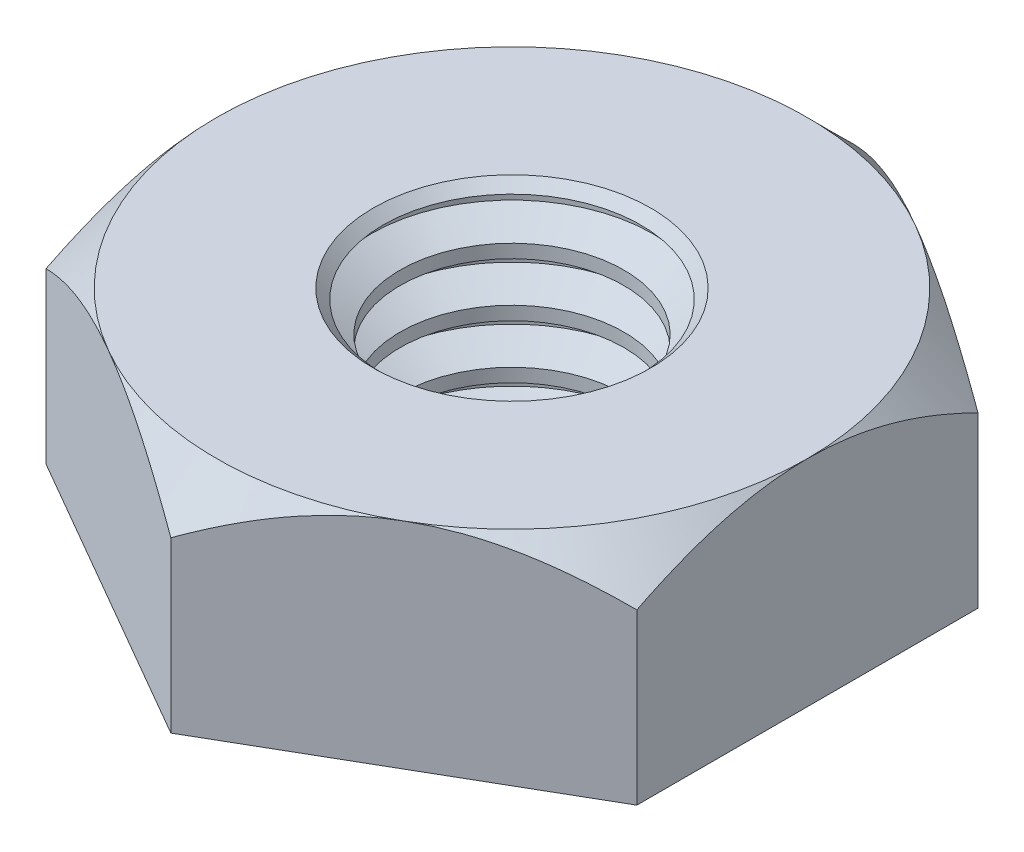
ISO-10303-21;
HEADER;
FILE_DESCRIPTION(('STEP AP214'),'2;1');
FILE_NAME('part.step','',(''),(''),'','','');
FILE_SCHEMA(('AUTOMOTIVE_DESIGN { 1 0 10303 214 1 1 1 1 }'));
ENDSEC;
DATA;
#1=APPLICATION_CONTEXT('core data for automotive mechanical design processes');
#2=APPLICATION_PROTOCOL_DEFINITION('international standard','automotive_design',2000,#1);
#3=PRODUCT_CONTEXT('',#1,'mechanical');
#4=PRODUCT('Part','Part','',(#3));
#5=PRODUCT_RELATED_PRODUCT_CATEGORY('part','',(#4));
#6=PRODUCT_DEFINITION_FORMATION('','',#4);
#7=PRODUCT_DEFINITION_CONTEXT('part definition',#1,'design');
#8=PRODUCT_DEFINITION('design','',#6,#7);
#9=PRODUCT_DEFINITION_SHAPE('','',#8);
#10=(LENGTH_UNIT() NAMED_UNIT(*) SI_UNIT(.MILLI.,.METRE.));
#11=(NAMED_UNIT(*) PLANE_ANGLE_UNIT() SI_UNIT($,.RADIAN.));
#12=(NAMED_UNIT(*) SI_UNIT($,.STERADIAN.) SOLID_ANGLE_UNIT());
#13=UNCERTAINTY_MEASURE_WITH_UNIT(LENGTH_MEASURE(1.E-05),#10,'distance_accuracy_value','');
#14=(GEOMETRIC_REPRESENTATION_CONTEXT(3) GLOBAL_UNCERTAINTY_ASSIGNED_CONTEXT((#13)) GLOBAL_UNIT_ASSIGNED_CONTEXT((#10,
#11,#12)) REPRESENTATION_CONTEXT('',''));
#15=CARTESIAN_POINT('',(0.,0.,0.));
#16=DIRECTION('',(0.,0.,1.));
#17=DIRECTION('',(1.,0.,0.));
#18=AXIS2_PLACEMENT_3D('',#15,#16,#17);
#19=CARTESIAN_POINT('',(0.,0.869828540984293,0.));
#20=DIRECTION('',(0.,1.,0.));
#21=DIRECTION('',(0.,0.,1.));
#22=AXIS2_PLACEMENT_3D('',#19,#20,#21);
#23=CYLINDRICAL_SURFACE('',#22,2.0828);
#24=CARTESIAN_POINT('',(0.,2.03398437497526,0.));
#25=DIRECTION('',(0.,1.,0.));
#26=DIRECTION('',(0.,0.,1.));
#27=AXIS2_PLACEMENT_3D('',#24,#25,#26);
#28=CIRCLE('',#27,2.0827999999824);
#29=CARTESIAN_POINT('',(0.,2.03398437497526,2.0827999999824));
#30=VERTEX_POINT('',#29);
#31=EDGE_CURVE('E346',#30,#30,#28,.F.);
#32=ORIENTED_EDGE('',*,*,#31,.T.);
#33=EDGE_LOOP('',(#32));
#34=FACE_BOUND('',#33,.T.);
#35=CARTESIAN_POINT('',(0.,2.13320312502674,0.));
#36=DIRECTION('',(0.,-1.,0.));
#37=DIRECTION('',(0.,0.,-1.));
#38=AXIS2_PLACEMENT_3D('',#35,#36,#37);
#39=CIRCLE('',#38,2.0827999999824);
#40=CARTESIAN_POINT('',(0.,2.13320312502674,-2.0827999999824));
#41=VERTEX_POINT('',#40);
#42=EDGE_CURVE('E342',#41,#41,#39,.F.);
#43=ORIENTED_EDGE('',*,*,#42,.T.);
#44=EDGE_LOOP('',(#43));
#45=FACE_BOUND('',#44,.T.);
#46=ADVANCED_FACE('F18',(#34,#45),#23,.F.);
#47=CARTESIAN_POINT('',(0.,2.03398437497526,0.));
#48=DIRECTION('',(0.,1.,0.));
#49=DIRECTION('',(0.,0.,1.));
#50=AXIS2_PLACEMENT_3D('',#47,#48,#49);
#51=CONICAL_SURFACE('',#50,2.0827999999824,1.04719755122981);
#52=CARTESIAN_POINT('',(0.,1.7859375,0.));
#53=DIRECTION('',(0.,1.,0.));
#54=DIRECTION('',(0.,0.,1.));
#55=AXIS2_PLACEMENT_3D('',#52,#53,#54);
#56=CIRCLE('',#55,1.65317020984131);
#57=CARTESIAN_POINT('',(0.,1.7859375,1.65317020984131));
#58=VERTEX_POINT('',#57);
#59=EDGE_CURVE('E338',#58,#58,#56,.F.);
#60=ORIENTED_EDGE('',*,*,#59,.T.);
#61=EDGE_LOOP('',(#60));
#62=FACE_BOUND('',#61,.T.);
#63=ORIENTED_EDGE('',*,*,#31,.F.);
#64=EDGE_LOOP('',(#63));
#65=FACE_BOUND('',#64,.T.);
#66=ADVANCED_FACE('F353',(#62,#65),#51,.F.);
#67=CARTESIAN_POINT('',(0.,2.13320312502674,0.));
#68=DIRECTION('',(0.,-1.,0.));
#69=DIRECTION('',(0.,0.,-1.));
#70=AXIS2_PLACEMENT_3D('',#67,#68,#69);
#71=CONICAL_SURFACE('',#70,2.0827999999824,1.04719755118787);
#72=CARTESIAN_POINT('',(0.,2.38125,0.));
#73=DIRECTION('',(0.,1.,0.));
#74=DIRECTION('',(0.,0.,1.));
#75=AXIS2_PLACEMENT_3D('',#72,#73,#74);
#76=CIRCLE('',#75,1.65317020984131);
#77=CARTESIAN_POINT('',(0.,2.38125,1.65317020984131));
#78=VERTEX_POINT('',#77);
#79=EDGE_CURVE('E334',#78,#78,#76,.T.);
#80=ORIENTED_EDGE('',*,*,#79,.T.);
#81=EDGE_LOOP('',(#80));
#82=FACE_BOUND('',#81,.T.);
#83=ORIENTED_EDGE('',*,*,#42,.F.);
#84=EDGE_LOOP('',(#83));
#85=FACE_BOUND('',#84,.T.);
#86=ADVANCED_FACE('F355',(#82,#85),#71,.F.);
#87=CARTESIAN_POINT('',(0.,0.869828540984293,0.));
#88=DIRECTION('',(0.,1.,0.));
#89=DIRECTION('',(0.,0.,1.));
#90=AXIS2_PLACEMENT_3D('',#87,#88,#89);
#91=CYLINDRICAL_SURFACE('',#90,1.65317020984131);
#92=CARTESIAN_POINT('',(0.,1.58750000002783,0.));
#93=DIRECTION('',(0.,-1.,0.));
#94=DIRECTION('',(0.,0.,-1.));
#95=AXIS2_PLACEMENT_3D('',#92,#93,#94);
#96=CIRCLE('',#95,1.65317020980638);
#97=CARTESIAN_POINT('',(0.,1.58750000002783,-1.65317020980638));
#98=VERTEX_POINT('',#97);
#99=EDGE_CURVE('E330',#98,#98,#96,.T.);
#100=ORIENTED_EDGE('',*,*,#99,.T.);
#101=EDGE_LOOP('',(#100));
#102=FACE_BOUND('',#101,.T.);
#103=ORIENTED_EDGE('',*,*,#59,.F.);
#104=EDGE_LOOP('',(#103));
#105=FACE_BOUND('',#104,.T.);
#106=ADVANCED_FACE('F361',(#102,#105),#91,.F.);
#107=CARTESIAN_POINT('',(0.,1.66357854098429,0.));
#108=DIRECTION('',(0.,1.,0.));
#109=DIRECTION('',(0.,0.,1.));
#110=AXIS2_PLACEMENT_3D('',#107,#108,#109);
#111=CYLINDRICAL_SURFACE('',#110,1.65317020984131);
#112=ORIENTED_EDGE('',*,*,#79,.F.);
#113=EDGE_LOOP('',(#112));
#114=FACE_BOUND('',#113,.T.);
#115=CARTESIAN_POINT('',(0.,2.57968749997417,0.));
#116=DIRECTION('',(0.,1.,0.));
#117=DIRECTION('',(0.,0.,1.));
#118=AXIS2_PLACEMENT_3D('',#115,#116,#117);
#119=CIRCLE('',#118,1.65317020986322);
#120=CARTESIAN_POINT('',(0.,2.57968749997417,1.65317020986322));
#121=VERTEX_POINT('',#120);
#122=EDGE_CURVE('E326',#121,#121,#119,.T.);
#123=ORIENTED_EDGE('',*,*,#122,.T.);
#124=EDGE_LOOP('',(#123));
#125=FACE_BOUND('',#124,.T.);
#126=ADVANCED_FACE('F367',(#114,#125),#111,.F.);
#127=CARTESIAN_POINT('',(0.,1.33945312501282,0.));
#128=DIRECTION('',(0.,-1.,0.));
#129=DIRECTION('',(0.,0.,-1.));
#130=AXIS2_PLACEMENT_3D('',#127,#128,#129);
#131=CONICAL_SURFACE('',#130,2.0827999999824,1.04719755118787);
#132=ORIENTED_EDGE('',*,*,#99,.F.);
#133=EDGE_LOOP('',(#132));
#134=FACE_BOUND('',#133,.T.);
#135=CARTESIAN_POINT('',(0.,1.339453125,0.));
#136=DIRECTION('',(0.,1.,0.));
#137=DIRECTION('',(0.,0.,1.));
#138=AXIS2_PLACEMENT_3D('',#135,#136,#137);
#139=CIRCLE('',#138,2.0828);
#140=CARTESIAN_POINT('',(0.,1.339453125,2.0828));
#141=VERTEX_POINT('',#140);
#142=EDGE_CURVE('E322',#141,#141,#139,.F.);
#143=ORIENTED_EDGE('',*,*,#142,.T.);
#144=EDGE_LOOP('',(#143));
#145=FACE_BOUND('',#144,.T.);
#146=ADVANCED_FACE('F371',(#134,#145),#131,.F.);
#147=CARTESIAN_POINT('',(0.,2.82773437493233,0.));
#148=DIRECTION('',(0.,1.,0.));
#149=DIRECTION('',(0.,0.,1.));
#150=AXIS2_PLACEMENT_3D('',#147,#148,#149);
#151=CONICAL_SURFACE('',#150,2.0827999999824,1.04719755122981);
#152=ORIENTED_EDGE('',*,*,#122,.F.);
#153=EDGE_LOOP('',(#152));
#154=FACE_BOUND('',#153,.T.);
#155=CARTESIAN_POINT('',(0.,2.827734375,0.));
#156=DIRECTION('',(0.,1.,0.));
#157=DIRECTION('',(0.,0.,1.));
#158=AXIS2_PLACEMENT_3D('',#155,#156,#157);
#159=CIRCLE('',#158,2.0828);
#160=CARTESIAN_POINT('',(0.,2.827734375,2.0828));
#161=VERTEX_POINT('',#160);
#162=EDGE_CURVE('E318',#161,#161,#159,.T.);
#163=ORIENTED_EDGE('',*,*,#162,.T.);
#164=EDGE_LOOP('',(#163));
#165=FACE_BOUND('',#164,.T.);
#166=ADVANCED_FACE('F375',(#154,#165),#151,.F.);
#167=CARTESIAN_POINT('',(0.,0.0760785409842932,0.));
#168=DIRECTION('',(0.,1.,0.));
#169=DIRECTION('',(0.,0.,1.));
#170=AXIS2_PLACEMENT_3D('',#167,#168,#169);
#171=CYLINDRICAL_SURFACE('',#170,2.0828);
#172=CARTESIAN_POINT('',(0.,1.24023437496135,0.));
#173=DIRECTION('',(0.,1.,0.));
#174=DIRECTION('',(0.,0.,1.));
#175=AXIS2_PLACEMENT_3D('',#172,#173,#174);
#176=CIRCLE('',#175,2.0827999999824);
#177=CARTESIAN_POINT('',(0.,1.24023437496135,2.0827999999824));
#178=VERTEX_POINT('',#177);
#179=EDGE_CURVE('E314',#178,#178,#176,.F.);
#180=ORIENTED_EDGE('',*,*,#179,.T.);
#181=EDGE_LOOP('',(#180));
#182=FACE_BOUND('',#181,.T.);
#183=ORIENTED_EDGE('',*,*,#142,.F.);
#184=EDGE_LOOP('',(#183));
#185=FACE_BOUND('',#184,.T.);
#186=ADVANCED_FACE('F379',(#182,#185),#171,.F.);
#187=CARTESIAN_POINT('',(0.,1.66357854098429,0.));
#188=DIRECTION('',(0.,1.,0.));
#189=DIRECTION('',(0.,0.,1.));
#190=AXIS2_PLACEMENT_3D('',#187,#188,#189);
#191=CYLINDRICAL_SURFACE('',#190,2.0828);
#192=ORIENTED_EDGE('',*,*,#162,.F.);
#193=EDGE_LOOP('',(#192));
#194=FACE_BOUND('',#193,.T.);
#195=CARTESIAN_POINT('',(0.,2.92695312498381,0.));
#196=DIRECTION('',(0.,-1.,0.));
#197=DIRECTION('',(0.,0.,-1.));
#198=AXIS2_PLACEMENT_3D('',#195,#196,#197);
#199=CIRCLE('',#198,2.08280000003924);
#200=CARTESIAN_POINT('',(0.,2.92695312498381,-2.08280000003924));
#201=VERTEX_POINT('',#200);
#202=EDGE_CURVE('E310',#201,#201,#199,.F.);
#203=ORIENTED_EDGE('',*,*,#202,.T.);
#204=EDGE_LOOP('',(#203));
#205=FACE_BOUND('',#204,.T.);
#206=ADVANCED_FACE('F383',(#194,#205),#191,.F.);
#207=CARTESIAN_POINT('',(0.,1.24023437496135,0.));
#208=DIRECTION('',(0.,1.,0.));
#209=DIRECTION('',(0.,0.,1.));
#210=AXIS2_PLACEMENT_3D('',#207,#208,#209);
#211=CONICAL_SURFACE('',#210,2.0827999999824,1.04719755122981);
#212=CARTESIAN_POINT('',(0.,0.992187499999999,0.));
#213=DIRECTION('',(0.,1.,0.));
#214=DIRECTION('',(0.,0.,1.));
#215=AXIS2_PLACEMENT_3D('',#212,#213,#214);
#216=CIRCLE('',#215,1.65317020984131);
#217=CARTESIAN_POINT('',(0.,0.992187499999999,1.65317020984131));
#218=VERTEX_POINT('',#217);
#219=EDGE_CURVE('E306',#218,#218,#216,.F.);
#220=ORIENTED_EDGE('',*,*,#219,.T.);
#221=EDGE_LOOP('',(#220));
#222=FACE_BOUND('',#221,.T.);
#223=ORIENTED_EDGE('',*,*,#179,.F.);
#224=EDGE_LOOP('',(#223));
#225=FACE_BOUND('',#224,.T.);
#226=ADVANCED_FACE('F387',(#222,#225),#211,.F.);
#227=CARTESIAN_POINT('',(0.,2.92695312504065,0.));
#228=DIRECTION('',(0.,-1.,0.));
#229=DIRECTION('',(0.,0.,-1.));
#230=AXIS2_PLACEMENT_3D('',#227,#228,#229);
#231=CONICAL_SURFACE('',#230,2.08279999992556,1.04719755117742);
#232=CARTESIAN_POINT('',(0.,3.02973366785864,0.));
#233=DIRECTION('',(0.,1.,0.));
#234=DIRECTION('',(0.,0.,1.));
#235=AXIS2_PLACEMENT_3D('',#232,#233,#234);
#236=CIRCLE('',#235,1.90477887770157);
#237=CARTESIAN_POINT('',(0.,3.02973366785864,1.90477887770157));
#238=VERTEX_POINT('',#237);
#239=EDGE_CURVE('E302',#238,#238,#236,.T.);
#240=ORIENTED_EDGE('',*,*,#239,.T.);
#241=EDGE_LOOP('',(#240));
#242=FACE_BOUND('',#241,.T.);
#243=ORIENTED_EDGE('',*,*,#202,.F.);
#244=EDGE_LOOP('',(#243));
#245=FACE_BOUND('',#244,.T.);
#246=ADVANCED_FACE('F391',(#242,#245),#231,.F.);
#247=CARTESIAN_POINT('',(0.,0.0760785409842932,0.));
#248=DIRECTION('',(0.,1.,0.));
#249=DIRECTION('',(0.,0.,1.));
#250=AXIS2_PLACEMENT_3D('',#247,#248,#249);
#251=CYLINDRICAL_SURFACE('',#250,1.65317020984131);
#252=CARTESIAN_POINT('',(0.,0.793750000013915,0.));
#253=DIRECTION('',(0.,-1.,0.));
#254=DIRECTION('',(0.,0.,-1.));
#255=AXIS2_PLACEMENT_3D('',#252,#253,#254);
#256=CIRCLE('',#255,1.65317020980638);
#257=CARTESIAN_POINT('',(0.,0.793750000013915,-1.65317020980638));
#258=VERTEX_POINT('',#257);
#259=EDGE_CURVE('E298',#258,#258,#256,.T.);
#260=ORIENTED_EDGE('',*,*,#259,.T.);
#261=EDGE_LOOP('',(#260));
#262=FACE_BOUND('',#261,.T.);
#263=ORIENTED_EDGE('',*,*,#219,.F.);
#264=EDGE_LOOP('',(#263));
#265=FACE_BOUND('',#264,.T.);
#266=ADVANCED_FACE('F395',(#262,#265),#251,.F.);
#267=CARTESIAN_POINT('',(0.,3.17499999994197,0.));
#268=DIRECTION('',(0.,1.,0.));
#269=DIRECTION('',(-1.,0.,0.));
#270=AXIS2_PLACEMENT_3D('',#267,#268,#269);
#271=CONICAL_SURFACE('',#270,2.05004520972807,0.785398163397448);
#272=ORIENTED_EDGE('',*,*,#239,.F.);
#273=EDGE_LOOP('',(#272));
#274=FACE_BOUND('',#273,.T.);
#275=CARTESIAN_POINT('',(0.,3.17499999999882,0.));
#276=DIRECTION('',(0.,1.,0.));
#277=DIRECTION('',(-1.,0.,0.));
#278=AXIS2_PLACEMENT_3D('',#275,#276,#277);
#279=CIRCLE('',#278,2.05004520978491);
#280=CARTESIAN_POINT('',(-2.05004520978491,3.17499999999882,0.));
#281=VERTEX_POINT('',#280);
#282=EDGE_CURVE('E21',#281,#281,#279,.F.);
#283=ORIENTED_EDGE('',*,*,#282,.F.);
#284=EDGE_LOOP('',(#283));
#285=FACE_BOUND('',#284,.T.);
#286=ADVANCED_FACE('F399',(#274,#285),#271,.F.);
#287=CARTESIAN_POINT('',(0.,0.545703124998909,0.));
#288=DIRECTION('',(0.,-1.,0.));
#289=DIRECTION('',(0.,0.,-1.));
#290=AXIS2_PLACEMENT_3D('',#287,#288,#289);
#291=CONICAL_SURFACE('',#290,2.0827999999824,1.04719755118787);
#292=ORIENTED_EDGE('',*,*,#259,.F.);
#293=EDGE_LOOP('',(#292));
#294=FACE_BOUND('',#293,.T.);
#295=CARTESIAN_POINT('',(0.,0.545703125,0.));
#296=DIRECTION('',(0.,1.,0.));
#297=DIRECTION('',(0.,0.,1.));
#298=AXIS2_PLACEMENT_3D('',#295,#296,#297);
#299=CIRCLE('',#298,2.0828);
#300=CARTESIAN_POINT('',(0.,0.545703125,2.0828));
#301=VERTEX_POINT('',#300);
#302=EDGE_CURVE('E117',#301,#301,#299,.F.);
#303=ORIENTED_EDGE('',*,*,#302,.T.);
#304=EDGE_LOOP('',(#303));
#305=FACE_BOUND('',#304,.T.);
#306=ADVANCED_FACE('F403',(#294,#305),#291,.F.);
#307=CARTESIAN_POINT('',(-4.365625,3.175,-7.56148430679289));
#308=DIRECTION('',(0.,1.,0.));
#309=DIRECTION('',(0.,0.,1.));
#310=AXIS2_PLACEMENT_3D('',#307,#308,#309);
#311=PLANE('',#310);
#312=CARTESIAN_POINT('',(0.,3.17500000005566,0.));
#313=DIRECTION('',(0.,-1.,0.));
#314=DIRECTION('',(0.,0.,-1.));
#315=AXIS2_PLACEMENT_3D('',#312,#313,#314);
#316=CIRCLE('',#315,4.36562499999127);
#317=CARTESIAN_POINT('',(-4.36562499999564,3.1750000000513,0.));
#318=VERTEX_POINT('',#317);
#319=CARTESIAN_POINT('',(-2.18281249999782,3.17500000005129,-3.78074215339266));
#320=VERTEX_POINT('',#319);
#321=EDGE_CURVE('E98',#318,#320,#316,.T.);
#322=ORIENTED_EDGE('',*,*,#321,.F.);
#323=CARTESIAN_POINT('',(0.,3.17500000005566,0.));
#324=DIRECTION('',(0.,-1.,0.));
#325=DIRECTION('',(0.,0.,-1.));
#326=AXIS2_PLACEMENT_3D('',#323,#324,#325);
#327=CIRCLE('',#326,4.36562499999127);
#328=CARTESIAN_POINT('',(-2.18281249999781,3.1750000000513,3.78074215339266));
#329=VERTEX_POINT('',#328);
#330=EDGE_CURVE('E88',#329,#318,#327,.T.);
#331=ORIENTED_EDGE('',*,*,#330,.F.);
#332=CARTESIAN_POINT('',(0.,3.17500000005566,0.));
#333=DIRECTION('',(0.,-1.,0.));
#334=DIRECTION('',(0.,0.,-1.));
#335=AXIS2_PLACEMENT_3D('',#332,#333,#334);
#336=CIRCLE('',#335,4.36562499999127);
#337=CARTESIAN_POINT('',(2.18281249999782,3.1750000000513,3.78074215339266));
#338=VERTEX_POINT('',#337);
#339=EDGE_CURVE('E450',#338,#329,#336,.T.);
#340=ORIENTED_EDGE('',*,*,#339,.F.);
#341=CARTESIAN_POINT('',(0.,3.17500000005566,0.));
#342=DIRECTION('',(0.,-1.,0.));
#343=DIRECTION('',(0.,0.,-1.));
#344=AXIS2_PLACEMENT_3D('',#341,#342,#343);
#345=CIRCLE('',#344,4.36562499999127);
#346=CARTESIAN_POINT('',(4.36562499999563,3.1750000000513,0.));
#347=VERTEX_POINT('',#346);
#348=EDGE_CURVE('E108',#347,#338,#345,.T.);
#349=ORIENTED_EDGE('',*,*,#348,.F.);
#350=CARTESIAN_POINT('',(0.,3.17500000005566,0.));
#351=DIRECTION('',(0.,-1.,0.));
#352=DIRECTION('',(0.,0.,-1.));
#353=AXIS2_PLACEMENT_3D('',#350,#351,#352);
#354=CIRCLE('',#353,4.36562499999127);
#355=CARTESIAN_POINT('',(2.18281249999782,3.17500000005129,-3.78074215339266));
#356=VERTEX_POINT('',#355);
#357=EDGE_CURVE('E101',#356,#347,#354,.T.);
#358=ORIENTED_EDGE('',*,*,#357,.F.);
#359=CARTESIAN_POINT('',(0.,3.17500000005566,0.));
#360=DIRECTION('',(0.,-1.,0.));
#361=DIRECTION('',(0.,0.,-1.));
#362=AXIS2_PLACEMENT_3D('',#359,#360,#361);
#363=CIRCLE('',#362,4.36562499999127);
#364=EDGE_CURVE('E94',#320,#356,#363,.T.);
#365=ORIENTED_EDGE('',*,*,#364,.F.);
#366=EDGE_LOOP('',(#322,#331,#340,#349,#358,#365));
#367=FACE_BOUND('',#366,.T.);
#368=ORIENTED_EDGE('',*,*,#282,.T.);
#369=EDGE_LOOP('',(#368));
#370=FACE_BOUND('',#369,.T.);
#371=ADVANCED_FACE('F96',(#367,#370),#311,.T.);
#372=CARTESIAN_POINT('',(0.,-0.717671459015707,0.));
#373=DIRECTION('',(0.,1.,0.));
#374=DIRECTION('',(0.,0.,1.));
#375=AXIS2_PLACEMENT_3D('',#372,#373,#374);
#376=CYLINDRICAL_SURFACE('',#375,2.0828);
#377=CARTESIAN_POINT('',(0.,0.446484374947431,0.));
#378=DIRECTION('',(0.,1.,0.));
#379=DIRECTION('',(0.,0.,1.));
#380=AXIS2_PLACEMENT_3D('',#377,#378,#379);
#381=CIRCLE('',#380,2.0827999999824);
#382=CARTESIAN_POINT('',(0.,0.446484374947431,2.0827999999824));
#383=VERTEX_POINT('',#382);
#384=EDGE_CURVE('E127',#383,#383,#381,.F.);
#385=ORIENTED_EDGE('',*,*,#384,.T.);
#386=EDGE_LOOP('',(#385));
#387=FACE_BOUND('',#386,.T.);
#388=ORIENTED_EDGE('',*,*,#302,.F.);
#389=EDGE_LOOP('',(#388));
#390=FACE_BOUND('',#389,.T.);
#391=ADVANCED_FACE('F410',(#387,#390),#376,.F.);
#392=CARTESIAN_POINT('',(0.,2.4955832749356,0.));
#393=DIRECTION('',(0.,-1.,0.));
#394=DIRECTION('',(0.,0.,-1.));
#395=AXIS2_PLACEMENT_3D('',#392,#393,#394);
#396=CONICAL_SURFACE('',#395,5.04504172511133,0.785398163397448);
#397=CARTESIAN_POINT('',(-4.36562499999411,2.49963546217304,-2.52049476894845));
#398=CARTESIAN_POINT('',(-4.36562499999783,2.54324275453271,-2.43326674459735));
#399=CARTESIAN_POINT('',(-4.36562499999941,2.58550324842416,-2.34536421688899));
#400=CARTESIAN_POINT('',(-4.3656250000006,2.66691908199156,-2.16807425242313));
#401=CARTESIAN_POINT('',(-4.36562500000021,2.70607262128386,-2.07868599048992));
#402=CARTESIAN_POINT('',(-4.36562499999958,2.81862374104814,-1.80717317415203));
#403=CARTESIAN_POINT('',(-4.36562499999989,2.88658477438753,-1.62273155020708));
#404=CARTESIAN_POINT('',(-4.36562500000011,3.0019580888393,-1.25323302597064));
#405=CARTESIAN_POINT('',(-4.36562500000002,3.04991017724918,-1.06834979941435));
#406=CARTESIAN_POINT('',(-4.36562499999999,3.10538619169057,-0.788070201273931));
#407=CARTESIAN_POINT('',(-4.365625,3.12112692052797,-0.694267939337319));
#408=CARTESIAN_POINT('',(-4.365625,3.14677629800422,-0.505879943403007));
#409=CARTESIAN_POINT('',(-4.365625,3.15668681082492,-0.411294469653338));
#410=CARTESIAN_POINT('',(-4.365625,3.16734304438852,-0.263942822368716));
#411=CARTESIAN_POINT('',(-4.365625,3.17020476274176,-0.211321695017855));
#412=CARTESIAN_POINT('',(-4.365625,3.17403808710303,-0.105802023975242));
#413=CARTESIAN_POINT('',(-4.365625,3.17500216145663,-0.0529032070391364));
#414=CARTESIAN_POINT('',(-4.365625,3.17500000004693,0.));
#415=B_SPLINE_CURVE_WITH_KNOTS('',3,(#397,#398,#399,#400,#401,#402,#403,#404,#405,#406,#407,
#408,#409,#410,#411,#412,#413,#414),.UNSPECIFIED.,.F.,.F.,(4,2,2,2,2,2,2,2,4),(0.,
0.292544920298723,0.585258141826927,1.17414935883964,1.74592553320374,2.03111562548428,
2.31621448005494,2.47428070082184,2.6329730235799),.UNSPECIFIED.);
#416=CARTESIAN_POINT('',(-4.36562500000813,2.49963546217562,-2.52049476893566));
#417=VERTEX_POINT('',#416);
#418=EDGE_CURVE('E115',#417,#318,#415,.T.);
#419=ORIENTED_EDGE('',*,*,#418,.T.);
#420=ORIENTED_EDGE('',*,*,#321,.T.);
#421=CARTESIAN_POINT('',(-2.1828125,3.17500000004693,-3.78074215339644));
#422=CARTESIAN_POINT('',(-2.24088063335592,3.17500536950647,-3.74721650097206));
#423=CARTESIAN_POINT('',(-2.29894008561082,3.173454471063,-3.7136958605837));
#424=CARTESIAN_POINT('',(-2.41492810419992,3.16729071988395,-3.64673014682851));
#425=CARTESIAN_POINT('',(-2.4728566896851,3.1626783488102,-3.61328506240486));
#426=CARTESIAN_POINT('',(-2.64607483494393,3.1443483111758,-3.51327751961115));
#427=CARTESIAN_POINT('',(-2.76102706509131,3.1261373201728,-3.44690981859161));
#428=CARTESIAN_POINT('',(-2.98744584430162,3.07905416408634,-3.31618687546495));
#429=CARTESIAN_POINT('',(-3.09893881659583,3.05034693100041,-3.25181637789814));
#430=CARTESIAN_POINT('',(-3.31980926123244,2.98351970619887,-3.12429676723116));
#431=CARTESIAN_POINT('',(-3.42918605943345,2.94539676651498,-3.06114804334671));
#432=CARTESIAN_POINT('',(-3.60806535680132,2.87573147293361,-2.95787203285892));
#433=CARTESIAN_POINT('',(-3.67825201910887,2.84648621389265,-2.91734974448214));
#434=CARTESIAN_POINT('',(-3.8175973665555,2.78494194484332,-2.8368986706235));
#435=CARTESIAN_POINT('',(-3.88675626496926,2.75264357893143,-2.79696976200746));
#436=CARTESIAN_POINT('',(-4.02478170233656,2.68498723818287,-2.71728073858843));
#437=CARTESIAN_POINT('',(-4.0936378237382,2.64960107964766,-2.67752663836184));
#438=CARTESIAN_POINT('',(-4.23036166252161,2.57637801313168,-2.5985890932356));
#439=CARTESIAN_POINT('',(-4.29822944536283,2.53854126837025,-2.55940561054292));
#440=CARTESIAN_POINT('',(-4.36562500001594,2.4996354621758,-2.52049476892176));
#441=B_SPLINE_CURVE_WITH_KNOTS('',3,(#421,#422,#423,#424,#425,#426,#427,#428,#429,#430,#431,
#432,#433,#434,#435,#436,#437,#438,#439,#440),.UNSPECIFIED.,.F.,.F.,(4,2,2,2,2,2,2,2,2,4),(0.,
0.201116813949766,0.402201993666422,0.803577632083508,1.19889980276363,1.59434590230986,
1.85276709955962,2.11113390032431,2.37217227229882,2.63319327586545),.UNSPECIFIED.);
#442=EDGE_CURVE('E113',#320,#417,#441,.T.);
#443=ORIENTED_EDGE('',*,*,#442,.T.);
#444=EDGE_LOOP('',(#419,#420,#443));
#445=FACE_BOUND('',#444,.T.);
#446=ADVANCED_FACE('F112',(#445),#396,.T.);
#447=CARTESIAN_POINT('',(0.,2.4955832749356,0.));
#448=DIRECTION('',(0.,-1.,0.));
#449=DIRECTION('',(0.,0.,-1.));
#450=AXIS2_PLACEMENT_3D('',#447,#448,#449);
#451=CONICAL_SURFACE('',#450,5.04504172511133,0.785398163397448);
#452=CARTESIAN_POINT('',(-4.3656250000122,2.49963546217304,2.52049476891711));
#453=CARTESIAN_POINT('',(-4.29008331500408,2.54324275453271,2.56410878109588));
#454=CARTESIAN_POINT('',(-4.21395749295256,2.58550324842416,2.60806004495143));
#455=CARTESIAN_POINT('',(-4.06041987988969,2.66691908199156,2.69670502718539));
#456=CARTESIAN_POINT('',(-3.98300737425519,2.70607262128386,2.74139915815166));
#457=CARTESIAN_POINT('',(-3.74787037785321,2.81862374104814,2.87715556632006));
#458=CARTESIAN_POINT('',(-3.58813924600178,2.88658477438753,2.9693763782928));
#459=CARTESIAN_POINT('',(-3.26814413735227,3.0019580888393,3.15412564041121));
#460=CARTESIAN_POINT('',(-3.10803056642084,3.04991017724918,3.24656725368928));
#461=CARTESIAN_POINT('',(-2.86530131426873,3.10538619169058,3.38670705275946));
#462=CARTESIAN_POINT('',(-2.78406617249919,3.12112692052797,3.43360818372778));
#463=CARTESIAN_POINT('',(-2.62091738225204,3.14677629800422,3.52780218169494));
#464=CARTESIAN_POINT('',(-2.53900395915584,3.15668681082492,3.57509491856977));
#465=CARTESIAN_POINT('',(-2.41139368931787,3.16734304438852,3.64877074221208));
#466=CARTESIAN_POINT('',(-2.36582245625625,3.17020476274176,3.67508130588751));
#467=CARTESIAN_POINT('',(-2.27443974053437,3.17403808710303,3.72784114140882));
#468=CARTESIAN_POINT('',(-2.22862802123756,3.17500216145663,3.75429054987687));
#469=CARTESIAN_POINT('',(-2.1828125,3.17500000004693,3.78074215339644));
#470=B_SPLINE_CURVE_WITH_KNOTS('',3,(#452,#453,#454,#455,#456,#457,#458,#459,#460,#461,#462,
#463,#464,#465,#466,#467,#468,#469),.UNSPECIFIED.,.F.,.F.,(4,2,2,2,2,2,2,2,4),(0.,
0.292544920298723,0.585258141826928,1.17414935883964,1.74592553320374,2.03111562548428,
2.31621448005495,2.47428070082185,2.6329730235799),.UNSPECIFIED.);
#471=CARTESIAN_POINT('',(-4.36562500000813,2.49963546217562,2.52049476893565));
#472=VERTEX_POINT('',#471);
#473=EDGE_CURVE('E234',#472,#329,#470,.T.);
#474=ORIENTED_EDGE('',*,*,#473,.T.);
#475=ORIENTED_EDGE('',*,*,#330,.T.);
#476=CARTESIAN_POINT('',(-4.365625,3.17500000004693,0.));
#477=CARTESIAN_POINT('',(-4.365625,3.17500536950647,0.0670513048487633));
#478=CARTESIAN_POINT('',(-4.365625,3.173454471063,0.134092585625493));
#479=CARTESIAN_POINT('',(-4.365625,3.16729071988395,0.268024013135877));
#480=CARTESIAN_POINT('',(-4.365625,3.16267834881021,0.334914181983163));
#481=CARTESIAN_POINT('',(-4.365625,3.1443483111758,0.534929267570585));
#482=CARTESIAN_POINT('',(-4.365625,3.1261373201728,0.667664669609663));
#483=CARTESIAN_POINT('',(-4.365625,3.07905416408634,0.929110555862982));
#484=CARTESIAN_POINT('',(-4.365625,3.05034693100041,1.05785155099661));
#485=CARTESIAN_POINT('',(-4.365625,2.98351970619888,1.31289077233057));
#486=CARTESIAN_POINT('',(-4.365625,2.94539676651499,1.43918822009947));
#487=CARTESIAN_POINT('',(-4.365625,2.87573147293361,1.64574024107505));
#488=CARTESIAN_POINT('',(-4.365625,2.84648621389266,1.72678481782861));
#489=CARTESIAN_POINT('',(-4.365625,2.78494194484333,1.88768696554589));
#490=CARTESIAN_POINT('',(-4.365625,2.75264357893143,1.96754478277796));
#491=CARTESIAN_POINT('',(-4.365625,2.68498723818287,2.12692282961602));
#492=CARTESIAN_POINT('',(-4.365625,2.64960107964766,2.20643103006921));
#493=CARTESIAN_POINT('',(-4.365625,2.57637801313168,2.36430612032168));
#494=CARTESIAN_POINT('',(-4.365625,2.53854126837025,2.44267308570704));
#495=CARTESIAN_POINT('',(-4.365625,2.49963546217581,2.52049476894937));
#496=B_SPLINE_CURVE_WITH_KNOTS('',3,(#476,#477,#478,#479,#480,#481,#482,#483,#484,#485,#486,
#487,#488,#489,#490,#491,#492,#493,#494,#495),.UNSPECIFIED.,.F.,.F.,(4,2,2,2,2,2,2,2,2,4),(0.,
0.201116813949766,0.402201993666422,0.803577632083508,1.19889980276363,1.59434590230986,
1.85276709955961,2.11113390032431,2.37217227229882,2.63319327586545),.UNSPECIFIED.);
#497=EDGE_CURVE('E132',#318,#472,#496,.T.);
#498=ORIENTED_EDGE('',*,*,#497,.T.);
#499=EDGE_LOOP('',(#474,#475,#498));
#500=FACE_BOUND('',#499,.T.);
#501=ADVANCED_FACE('F223',(#500),#451,.T.);
#502=CARTESIAN_POINT('',(0.,2.4955832749356,0.));
#503=DIRECTION('',(0.,-1.,0.));
#504=DIRECTION('',(0.,0.,-1.));
#505=AXIS2_PLACEMENT_3D('',#502,#503,#504);
#506=CONICAL_SURFACE('',#505,5.04504172511133,0.785398163397448);
#507=CARTESIAN_POINT('',(-1.80912821206199E-11,2.49963546217304,5.04098953786556));
#508=CARTESIAN_POINT('',(0.075541684993749,2.54324275453271,4.99737552569323));
#509=CARTESIAN_POINT('',(0.151667507046842,2.58550324842416,4.95342426184042));
#510=CARTESIAN_POINT('',(0.305205120110909,2.66691908199156,4.86477927960852));
#511=CARTESIAN_POINT('',(0.382617625745014,2.70607262128386,4.82008514864158));
#512=CARTESIAN_POINT('',(0.617754622146372,2.81862374104814,4.68432874047209));
#513=CARTESIAN_POINT('',(0.777485753998107,2.88658477438753,4.59210792849989));
#514=CARTESIAN_POINT('',(1.09748086264783,3.0019580888393,4.40735866638185));
#515=CARTESIAN_POINT('',(1.25759443357918,3.04991017724918,4.31491705310363));
#516=CARTESIAN_POINT('',(1.50032368573126,3.10538619169058,4.1747772540334));
#517=CARTESIAN_POINT('',(1.58155882750081,3.12112692052797,4.1278761230651));
#518=CARTESIAN_POINT('',(1.74470761774796,3.14677629800422,4.03368212509794));
#519=CARTESIAN_POINT('',(1.82662104084416,3.15668681082492,3.98638938822311));
#520=CARTESIAN_POINT('',(1.95423131068213,3.16734304438852,3.9127135645808));
#521=CARTESIAN_POINT('',(1.99980254374375,3.17020476274176,3.88640300090537));
#522=CARTESIAN_POINT('',(2.09118525946563,3.17403808710303,3.83364316538406));
#523=CARTESIAN_POINT('',(2.13699697876244,3.17500216145663,3.80719375691601));
#524=CARTESIAN_POINT('',(2.1828125,3.17500000004693,3.78074215339644));
#525=B_SPLINE_CURVE_WITH_KNOTS('',3,(#507,#508,#509,#510,#511,#512,#513,#514,#515,#516,#517,
#518,#519,#520,#521,#522,#523,#524),.UNSPECIFIED.,.F.,.F.,(4,2,2,2,2,2,2,2,4),(0.,
0.292544920298723,0.585258141826928,1.17414935883964,1.74592553320374,2.03111562548428,
2.31621448005495,2.47428070082185,2.6329730235799),.UNSPECIFIED.);
#526=CARTESIAN_POINT('',(0.,2.49963546217562,5.0409895378713));
#527=VERTEX_POINT('',#526);
#528=EDGE_CURVE('E207',#527,#338,#525,.T.);
#529=ORIENTED_EDGE('',*,*,#528,.T.);
#530=ORIENTED_EDGE('',*,*,#339,.T.);
#531=CARTESIAN_POINT('',(-2.1828125,3.17500000004693,3.78074215339644));
#532=CARTESIAN_POINT('',(-2.12474436664407,3.17500536950648,3.81426780582082));
#533=CARTESIAN_POINT('',(-2.06668491438918,3.173454471063,3.84778844620919));
#534=CARTESIAN_POINT('',(-1.95069689580007,3.16729071988395,3.91475415996438));
#535=CARTESIAN_POINT('',(-1.89276831031489,3.16267834881021,3.94819924438802));
#536=CARTESIAN_POINT('',(-1.71955016505607,3.1443483111758,4.04820678718173));
#537=CARTESIAN_POINT('',(-1.60459793490869,3.12613732017281,4.11457448820127));
#538=CARTESIAN_POINT('',(-1.37817915569838,3.07905416408634,4.24529743132793));
#539=CARTESIAN_POINT('',(-1.26668618340417,3.05034693100041,4.30966792889474));
#540=CARTESIAN_POINT('',(-1.04581573876756,2.98351970619888,4.43718753956172));
#541=CARTESIAN_POINT('',(-0.936438940566551,2.94539676651499,4.50033626344617));
#542=CARTESIAN_POINT('',(-0.757559643198678,2.87573147293361,4.60361227393396));
#543=CARTESIAN_POINT('',(-0.687372980891135,2.84648621389266,4.64413456231075));
#544=CARTESIAN_POINT('',(-0.548027633444498,2.78494194484333,4.72458563616938));
#545=CARTESIAN_POINT('',(-0.478868735030746,2.75264357893143,4.76451454478542));
#546=CARTESIAN_POINT('',(-0.340843297663445,2.68498723818287,4.84420356820445));
#547=CARTESIAN_POINT('',(-0.271987176261797,2.64960107964766,4.88395766843104));
#548=CARTESIAN_POINT('',(-0.135263337478396,2.57637801313168,4.96289521355728));
#549=CARTESIAN_POINT('',(-0.0673955546371766,2.53854126837025,5.00207869624996));
#550=CARTESIAN_POINT('',(1.59417790519942E-11,2.49963546217581,5.04098953787112));
#551=B_SPLINE_CURVE_WITH_KNOTS('',3,(#531,#532,#533,#534,#535,#536,#537,#538,#539,#540,#541,
#542,#543,#544,#545,#546,#547,#548,#549,#550),.UNSPECIFIED.,.F.,.F.,(4,2,2,2,2,2,2,2,2,4),(0.,
0.201116813949765,0.402201993666421,0.803577632083507,1.19889980276363,1.59434590230986,
1.85276709955961,2.11113390032431,2.37217227229882,2.63319327586545),.UNSPECIFIED.);
#552=EDGE_CURVE('E228',#329,#527,#551,.T.);
#553=ORIENTED_EDGE('',*,*,#552,.T.);
#554=EDGE_LOOP('',(#529,#530,#553));
#555=FACE_BOUND('',#554,.T.);
#556=ADVANCED_FACE('F220',(#555),#506,.T.);
#557=CARTESIAN_POINT('',(0.,2.4955832749356,0.));
#558=DIRECTION('',(0.,-1.,0.));
#559=DIRECTION('',(0.,0.,-1.));
#560=AXIS2_PLACEMENT_3D('',#557,#558,#559);
#561=CONICAL_SURFACE('',#560,5.04504172511133,0.785398163397448);
#562=CARTESIAN_POINT('',(4.3656249999941,2.49963546217304,2.52049476894845));
#563=CARTESIAN_POINT('',(4.36562499999783,2.54324275453271,2.43326674459735));
#564=CARTESIAN_POINT('',(4.3656249999994,2.58550324842416,2.34536421688899));
#565=CARTESIAN_POINT('',(4.36562500000059,2.66691908199156,2.16807425242313));
#566=CARTESIAN_POINT('',(4.36562500000021,2.70607262128386,2.07868599048992));
#567=CARTESIAN_POINT('',(4.36562499999958,2.81862374104814,1.80717317415203));
#568=CARTESIAN_POINT('',(4.36562499999989,2.88658477438753,1.62273155020709));
#569=CARTESIAN_POINT('',(4.3656250000001,3.0019580888393,1.25323302597064));
#570=CARTESIAN_POINT('',(4.36562500000002,3.04991017724918,1.06834979941435));
#571=CARTESIAN_POINT('',(4.36562499999999,3.10538619169058,0.788070201273932));
#572=CARTESIAN_POINT('',(4.36562499999999,3.12112692052797,0.694267939337319));
#573=CARTESIAN_POINT('',(4.365625,3.14677629800423,0.505879943403006));
#574=CARTESIAN_POINT('',(4.365625,3.15668681082492,0.411294469653337));
#575=CARTESIAN_POINT('',(4.365625,3.16734304438852,0.263942822368715));
#576=CARTESIAN_POINT('',(4.365625,3.17020476274176,0.211321695017854));
#577=CARTESIAN_POINT('',(4.365625,3.17403808710304,0.105802023975241));
#578=CARTESIAN_POINT('',(4.365625,3.17500216145663,0.052903207039136));
#579=CARTESIAN_POINT('',(4.365625,3.17500000004693,0.));
#580=B_SPLINE_CURVE_WITH_KNOTS('',3,(#562,#563,#564,#565,#566,#567,#568,#569,#570,#571,#572,
#573,#574,#575,#576,#577,#578,#579),.UNSPECIFIED.,.F.,.F.,(4,2,2,2,2,2,2,2,4),(0.,
0.292544920298724,0.585258141826929,1.17414935883964,1.74592553320374,2.03111562548428,
2.31621448005495,2.47428070082185,2.6329730235799),.UNSPECIFIED.);
#581=CARTESIAN_POINT('',(4.36562500000812,2.49963546217562,2.52049476893566));
#582=VERTEX_POINT('',#581);
#583=EDGE_CURVE('E174',#582,#347,#580,.T.);
#584=ORIENTED_EDGE('',*,*,#583,.T.);
#585=ORIENTED_EDGE('',*,*,#348,.T.);
#586=CARTESIAN_POINT('',(2.1828125,3.17500000004693,3.78074215339644));
#587=CARTESIAN_POINT('',(2.24088063335592,3.17500536950647,3.74721650097206));
#588=CARTESIAN_POINT('',(2.29894008561082,3.173454471063,3.71369586058369));
#589=CARTESIAN_POINT('',(2.41492810419992,3.16729071988395,3.6467301468285));
#590=CARTESIAN_POINT('',(2.4728566896851,3.16267834881021,3.61328506240486));
#591=CARTESIAN_POINT('',(2.64607483494393,3.1443483111758,3.51327751961115));
#592=CARTESIAN_POINT('',(2.76102706509131,3.12613732017281,3.44690981859161));
#593=CARTESIAN_POINT('',(2.98744584430162,3.07905416408634,3.31618687546495));
#594=CARTESIAN_POINT('',(3.09893881659583,3.05034693100041,3.25181637789813));
#595=CARTESIAN_POINT('',(3.31980926123244,2.98351970619888,3.12429676723116));
#596=CARTESIAN_POINT('',(3.42918605943345,2.94539676651499,3.06114804334671));
#597=CARTESIAN_POINT('',(3.60806535680132,2.87573147293361,2.95787203285891));
#598=CARTESIAN_POINT('',(3.67825201910886,2.84648621389266,2.91734974448213));
#599=CARTESIAN_POINT('',(3.8175973665555,2.78494194484333,2.83689867062349));
#600=CARTESIAN_POINT('',(3.88675626496925,2.75264357893143,2.79696976200746));
#601=CARTESIAN_POINT('',(4.02478170233655,2.68498723818287,2.71728073858843));
#602=CARTESIAN_POINT('',(4.0936378237382,2.64960107964766,2.67752663836184));
#603=CARTESIAN_POINT('',(4.2303616625216,2.57637801313168,2.5985890932356));
#604=CARTESIAN_POINT('',(4.29822944536282,2.53854126837025,2.55940561054292));
#605=CARTESIAN_POINT('',(4.36562500001594,2.49963546217581,2.52049476892176));
#606=B_SPLINE_CURVE_WITH_KNOTS('',3,(#586,#587,#588,#589,#590,#591,#592,#593,#594,#595,#596,
#597,#598,#599,#600,#601,#602,#603,#604,#605),.UNSPECIFIED.,.F.,.F.,(4,2,2,2,2,2,2,2,2,4),(0.,
0.201116813949766,0.402201993666422,0.803577632083509,1.19889980276363,1.59434590230986,
1.85276709955961,2.11113390032431,2.37217227229882,2.63319327586544),.UNSPECIFIED.);
#607=EDGE_CURVE('E215',#338,#582,#606,.T.);
#608=ORIENTED_EDGE('',*,*,#607,.T.);
#609=EDGE_LOOP('',(#584,#585,#608));
#610=FACE_BOUND('',#609,.T.);
#611=ADVANCED_FACE('F160',(#610),#561,.T.);
#612=CARTESIAN_POINT('',(0.,2.4955832749356,0.));
#613=DIRECTION('',(0.,-1.,0.));
#614=DIRECTION('',(0.,0.,-1.));
#615=AXIS2_PLACEMENT_3D('',#612,#613,#614);
#616=CONICAL_SURFACE('',#615,5.04504172511133,0.785398163397448);
#617=ORIENTED_EDGE('',*,*,#364,.T.);
#618=CARTESIAN_POINT('',(2.1828125,3.17500000004692,-3.78074215339645));
#619=CARTESIAN_POINT('',(2.12474436664408,3.17500536950647,-3.81426780582083));
#620=CARTESIAN_POINT('',(2.06668491438919,3.17345447106299,-3.84778844620919));
#621=CARTESIAN_POINT('',(1.95069689580008,3.16729071988394,-3.91475415996439));
#622=CARTESIAN_POINT('',(1.8927683103149,3.1626783488102,-3.94819924438803));
#623=CARTESIAN_POINT('',(1.71955016505607,3.14434831117579,-4.04820678718174));
#624=CARTESIAN_POINT('',(1.60459793490869,3.1261373201728,-4.11457448820128));
#625=CARTESIAN_POINT('',(1.37817915569838,3.07905416408633,-4.24529743132794));
#626=CARTESIAN_POINT('',(1.26668618340417,3.0503469310004,-4.30966792889475));
#627=CARTESIAN_POINT('',(1.04581573876756,2.98351970619887,-4.43718753956173));
#628=CARTESIAN_POINT('',(0.936438940566555,2.94539676651498,-4.50033626344618));
#629=CARTESIAN_POINT('',(0.757559643198902,2.87573147293369,-4.60361227393385));
#630=CARTESIAN_POINT('',(0.687372980891577,2.84648621389283,-4.6441345623105));
#631=CARTESIAN_POINT('',(0.548027633445371,2.78494194484371,-4.72458563616889));
#632=CARTESIAN_POINT('',(0.478868735031832,2.75264357893193,-4.76451454478481));
#633=CARTESIAN_POINT('',(0.340843297664954,2.68498723818362,-4.84420356820359));
#634=CARTESIAN_POINT('',(0.271987176263516,2.64960107964854,-4.88395766843006));
#635=CARTESIAN_POINT('',(0.13526333748053,2.57637801313284,-4.96289521355606));
#636=CARTESIAN_POINT('',(0.0673955546395157,2.53854126837156,-5.00207869624862));
#637=CARTESIAN_POINT('',(-1.34003942456213E-11,2.49963546217726,-5.04098953786967));
#638=B_SPLINE_CURVE_WITH_KNOTS('',3,(#618,#619,#620,#621,#622,#623,#624,#625,#626,#627,#628,
#629,#630,#631,#632,#633,#634,#635,#636,#637),.UNSPECIFIED.,.F.,.F.,(4,2,2,2,2,2,2,2,2,4),(0.,
0.201116813949765,0.402201993666421,0.803577632083507,1.19889980276363,1.59434590230986,
1.85276709955881,2.1111339003227,2.37217227229637,2.63319327586217),.UNSPECIFIED.);
#639=CARTESIAN_POINT('',(0.,2.49963546215781,-5.040989537861));
#640=VERTEX_POINT('',#639);
#641=EDGE_CURVE('E130',#356,#640,#638,.T.);
#642=ORIENTED_EDGE('',*,*,#641,.T.);
#643=CARTESIAN_POINT('',(1.34073036237253E-11,2.49963546217727,-5.04098953786966));
#644=CARTESIAN_POINT('',(-0.0755416849972436,2.54324275453525,-4.99737552569373));
#645=CARTESIAN_POINT('',(-0.151667507049825,2.58550324842594,-4.95342426183939));
#646=CARTESIAN_POINT('',(-0.305205120113501,2.66691908199272,-4.86477927960634));
#647=CARTESIAN_POINT('',(-0.382617625747729,2.70607262128514,-4.82008514863978));
#648=CARTESIAN_POINT('',(-0.617754622149316,2.81862374104956,-4.68432874047088));
#649=CARTESIAN_POINT('',(-0.777485754000984,2.88658477438872,-4.59210792849836));
#650=CARTESIAN_POINT('',(-1.09748086265075,3.0019580888402,-4.40735866638005));
#651=CARTESIAN_POINT('',(-1.25759443358218,3.04991017725,-4.31491705310187));
#652=CARTESIAN_POINT('',(-1.50032368573437,3.10538619169121,-4.17477725403161));
#653=CARTESIAN_POINT('',(-1.58155882750394,3.12112692052854,-4.12787612306329));
#654=CARTESIAN_POINT('',(-1.74470761775115,3.14677629800464,-4.03368212509611));
#655=CARTESIAN_POINT('',(-1.82662104084737,3.15668681082527,-3.98638938822126));
#656=CARTESIAN_POINT('',(-1.95423131068483,3.1673430443887,-3.91271356457924));
#657=CARTESIAN_POINT('',(-1.99980254374591,3.17020476274187,-3.88640300090412));
#658=CARTESIAN_POINT('',(-2.09118525946672,3.17403808710305,-3.83364316538344));
#659=CARTESIAN_POINT('',(-2.13699697876298,3.17500216145662,-3.8071937569157));
#660=CARTESIAN_POINT('',(-2.1828125,3.17500000004693,-3.78074215339644));
#661=B_SPLINE_CURVE_WITH_KNOTS('',3,(#643,#644,#645,#646,#647,#648,#649,#650,#651,#652,#653,
#654,#655,#656,#657,#658,#659,#660),.UNSPECIFIED.,.F.,.F.,(4,2,2,2,2,2,2,2,4),(0.,
0.292544920298615,0.585258141826763,1.17414935883947,1.74592553320372,2.03111562548432,
2.31621448005504,2.47428070082008,2.63297302357625),.UNSPECIFIED.);
#662=EDGE_CURVE('E122',#640,#320,#661,.T.);
#663=ORIENTED_EDGE('',*,*,#662,.T.);
#664=EDGE_LOOP('',(#617,#642,#663));
#665=FACE_BOUND('',#664,.T.);
#666=ADVANCED_FACE('F129',(#665),#616,.T.);
#667=CARTESIAN_POINT('',(0.,2.4955832749356,0.));
#668=DIRECTION('',(0.,-1.,0.));
#669=DIRECTION('',(0.,0.,-1.));
#670=AXIS2_PLACEMENT_3D('',#667,#668,#669);
#671=CONICAL_SURFACE('',#670,5.04504172511133,0.785398163397448);
#672=ORIENTED_EDGE('',*,*,#357,.T.);
#673=CARTESIAN_POINT('',(4.365625,3.17500000004693,0.));
#674=CARTESIAN_POINT('',(4.365625,3.17500536950648,-0.0670513048487638));
#675=CARTESIAN_POINT('',(4.365625,3.173454471063,-0.134092585625493));
#676=CARTESIAN_POINT('',(4.365625,3.16729071988395,-0.268024013135877));
#677=CARTESIAN_POINT('',(4.365625,3.16267834881021,-0.334914181983163));
#678=CARTESIAN_POINT('',(4.365625,3.1443483111758,-0.534929267570585));
#679=CARTESIAN_POINT('',(4.365625,3.12613732017281,-0.667664669609662));
#680=CARTESIAN_POINT('',(4.365625,3.07905416408634,-0.929110555862982));
#681=CARTESIAN_POINT('',(4.365625,3.05034693100042,-1.05785155099661));
#682=CARTESIAN_POINT('',(4.365625,2.98351970619888,-1.31289077233057));
#683=CARTESIAN_POINT('',(4.365625,2.94539676651499,-1.43918822009947));
#684=CARTESIAN_POINT('',(4.365625,2.87573147293361,-1.64574024107505));
#685=CARTESIAN_POINT('',(4.365625,2.84648621389266,-1.72678481782862));
#686=CARTESIAN_POINT('',(4.365625,2.78494194484333,-1.8876869655459));
#687=CARTESIAN_POINT('',(4.365625,2.75264357893143,-1.96754478277797));
#688=CARTESIAN_POINT('',(4.365625,2.68498723818287,-2.12692282961603));
#689=CARTESIAN_POINT('',(4.365625,2.64960107964766,-2.20643103006922));
#690=CARTESIAN_POINT('',(4.365625,2.57637801313168,-2.3643061203217));
#691=CARTESIAN_POINT('',(4.365625,2.53854126837025,-2.44267308570706));
#692=CARTESIAN_POINT('',(4.365625,2.4996354621758,-2.52049476894938));
#693=B_SPLINE_CURVE_WITH_KNOTS('',3,(#673,#674,#675,#676,#677,#678,#679,#680,#681,#682,#683,
#684,#685,#686,#687,#688,#689,#690,#691,#692),.UNSPECIFIED.,.F.,.F.,(4,2,2,2,2,2,2,2,2,4),(0.,
0.201116813949766,0.402201993666422,0.803577632083507,1.19889980276363,1.59434590230986,
1.85276709955962,2.11113390032432,2.37217227229883,2.63319327586547),.UNSPECIFIED.);
#694=CARTESIAN_POINT('',(4.36562500000812,2.49963546217562,-2.52049476893567));
#695=VERTEX_POINT('',#694);
#696=EDGE_CURVE('E200',#347,#695,#693,.T.);
#697=ORIENTED_EDGE('',*,*,#696,.T.);
#698=CARTESIAN_POINT('',(4.36562500001219,2.49963546217304,-2.52049476891713));
#699=CARTESIAN_POINT('',(4.29008331500407,2.54324275453272,-2.5641087810959));
#700=CARTESIAN_POINT('',(4.21395749295255,2.58550324842416,-2.60806004495145));
#701=CARTESIAN_POINT('',(4.06041987988967,2.66691908199156,-2.6967050271854));
#702=CARTESIAN_POINT('',(3.98300737425518,2.70607262128386,-2.74139915815167));
#703=CARTESIAN_POINT('',(3.7478703778532,2.81862374104813,-2.87715556632008));
#704=CARTESIAN_POINT('',(3.58813924600178,2.88658477438753,-2.96937637829282));
#705=CARTESIAN_POINT('',(3.26814413735226,3.0019580888393,-3.15412564041122));
#706=CARTESIAN_POINT('',(3.10803056642084,3.04991017724917,-3.2465672536893));
#707=CARTESIAN_POINT('',(2.86530131426873,3.10538619169057,-3.38670705275948));
#708=CARTESIAN_POINT('',(2.78406617249919,3.12112692052796,-3.43360818372779));
#709=CARTESIAN_POINT('',(2.62091738225204,3.14677629800422,-3.52780218169495));
#710=CARTESIAN_POINT('',(2.53900395915584,3.15668681082491,-3.57509491856978));
#711=CARTESIAN_POINT('',(2.41139368931787,3.16734304438851,-3.64877074221209));
#712=CARTESIAN_POINT('',(2.36582245625625,3.17020476274175,-3.67508130588752));
#713=CARTESIAN_POINT('',(2.27443974053437,3.17403808710303,-3.72784114140883));
#714=CARTESIAN_POINT('',(2.22862802123756,3.17500216145662,-3.75429054987688));
#715=CARTESIAN_POINT('',(2.1828125,3.17500000004692,-3.78074215339645));
#716=B_SPLINE_CURVE_WITH_KNOTS('',3,(#698,#699,#700,#701,#702,#703,#704,#705,#706,#707,#708,
#709,#710,#711,#712,#713,#714,#715),.UNSPECIFIED.,.F.,.F.,(4,2,2,2,2,2,2,2,4),(0.,
0.292544920298721,0.585258141826925,1.17414935883963,1.74592553320373,2.03111562548427,
2.31621448005493,2.47428070082183,2.63297302357987),.UNSPECIFIED.);
#717=EDGE_CURVE('E175',#695,#356,#716,.T.);
#718=ORIENTED_EDGE('',*,*,#717,.T.);
#719=EDGE_LOOP('',(#672,#697,#718));
#720=FACE_BOUND('',#719,.T.);
#721=ADVANCED_FACE('F159',(#720),#671,.T.);
#722=CARTESIAN_POINT('',(0.,0.446484374947431,0.));
#723=DIRECTION('',(0.,1.,0.));
#724=DIRECTION('',(-1.,0.,0.));
#725=AXIS2_PLACEMENT_3D('',#722,#723,#724);
#726=CONICAL_SURFACE('',#725,2.0827999999824,1.04719755122981);
#727=CARTESIAN_POINT('',(0.,0.198437499999999,0.));
#728=DIRECTION('',(0.,1.,0.));
#729=DIRECTION('',(0.,0.,1.));
#730=AXIS2_PLACEMENT_3D('',#727,#728,#729);
#731=CIRCLE('',#730,1.65317020984131);
#732=CARTESIAN_POINT('',(0.,0.198437499999999,1.65317020984131));
#733=VERTEX_POINT('',#732);
#734=EDGE_CURVE('E433',#733,#733,#731,.F.);
#735=ORIENTED_EDGE('',*,*,#734,.T.);
#736=EDGE_LOOP('',(#735));
#737=FACE_BOUND('',#736,.T.);
#738=ORIENTED_EDGE('',*,*,#384,.F.);
#739=EDGE_LOOP('',(#738));
#740=FACE_BOUND('',#739,.T.);
#741=ADVANCED_FACE('F255',(#737,#740),#726,.F.);
#742=CARTESIAN_POINT('',(0.,3.175,-5.04098953786193));
#743=DIRECTION('',(0.5,0.,0.866025403784439));
#744=DIRECTION('',(0.866025403784439,0.,-0.5));
#745=AXIS2_PLACEMENT_3D('',#742,#743,#744);
#746=PLANE('',#745);
#747=DIRECTION('',(0.,1.,0.));
#748=VECTOR('',#747,1.);
#749=CARTESIAN_POINT('',(0.,3.175,-5.04098953786193));
#750=LINE('',#749,#748);
#751=CARTESIAN_POINT('',(0.,0.,-5.04098953786193));
#752=VERTEX_POINT('',#751);
#753=EDGE_CURVE('E173',#640,#752,#750,.F.);
#754=ORIENTED_EDGE('',*,*,#753,.T.);
#755=DIRECTION('',(-0.866025403784439,0.,0.5));
#756=VECTOR('',#755,1.);
#757=CARTESIAN_POINT('',(0.,0.,-5.04098953786193));
#758=LINE('',#757,#756);
#759=CARTESIAN_POINT('',(-4.365625,0.,-2.52049476893096));
#760=VERTEX_POINT('',#759);
#761=EDGE_CURVE('E287',#752,#760,#758,.T.);
#762=ORIENTED_EDGE('',*,*,#761,.T.);
#763=DIRECTION('',(0.,1.,0.));
#764=VECTOR('',#763,1.);
#765=CARTESIAN_POINT('',(-4.365625,3.175,-2.52049476893096));
#766=LINE('',#765,#764);
#767=EDGE_CURVE('E125',#760,#417,#766,.T.);
#768=ORIENTED_EDGE('',*,*,#767,.T.);
#769=ORIENTED_EDGE('',*,*,#442,.F.);
#770=ORIENTED_EDGE('',*,*,#662,.F.);
#771=EDGE_LOOP('',(#754,#762,#768,#769,#770));
#772=FACE_BOUND('',#771,.T.);
#773=ADVANCED_FACE('F121',(#772),#746,.F.);
#774=CARTESIAN_POINT('',(-4.365625,3.175,-2.52049476893096));
#775=DIRECTION('',(1.,0.,0.));
#776=DIRECTION('',(0.,0.,-1.));
#777=AXIS2_PLACEMENT_3D('',#774,#775,#776);
#778=PLANE('',#777);
#779=ORIENTED_EDGE('',*,*,#767,.F.);
#780=DIRECTION('',(0.,0.,1.));
#781=VECTOR('',#780,1.);
#782=CARTESIAN_POINT('',(-4.365625,0.,-7.56148430679289));
#783=LINE('',#782,#781);
#784=CARTESIAN_POINT('',(-4.365625,0.,2.52049476893096));
#785=VERTEX_POINT('',#784);
#786=EDGE_CURVE('E284',#760,#785,#783,.T.);
#787=ORIENTED_EDGE('',*,*,#786,.T.);
#788=DIRECTION('',(0.,1.,0.));
#789=VECTOR('',#788,1.);
#790=CARTESIAN_POINT('',(-4.365625,3.175,2.52049476893096));
#791=LINE('',#790,#789);
#792=EDGE_CURVE('E233',#785,#472,#791,.T.);
#793=ORIENTED_EDGE('',*,*,#792,.T.);
#794=ORIENTED_EDGE('',*,*,#497,.F.);
#795=ORIENTED_EDGE('',*,*,#418,.F.);
#796=EDGE_LOOP('',(#779,#787,#793,#794,#795));
#797=FACE_BOUND('',#796,.T.);
#798=ADVANCED_FACE('F244',(#797),#778,.F.);
#799=CARTESIAN_POINT('',(-4.365625,3.175,2.52049476893096));
#800=DIRECTION('',(0.5,0.,-0.866025403784439));
#801=DIRECTION('',(-0.866025403784439,0.,-0.5));
#802=AXIS2_PLACEMENT_3D('',#799,#800,#801);
#803=PLANE('',#802);
#804=ORIENTED_EDGE('',*,*,#792,.F.);
#805=DIRECTION('',(0.866025403784439,0.,0.5));
#806=VECTOR('',#805,1.);
#807=CARTESIAN_POINT('',(-4.365625,0.,2.52049476893096));
#808=LINE('',#807,#806);
#809=CARTESIAN_POINT('',(0.,0.,5.04098953786192));
#810=VERTEX_POINT('',#809);
#811=EDGE_CURVE('E281',#785,#810,#808,.T.);
#812=ORIENTED_EDGE('',*,*,#811,.T.);
#813=DIRECTION('',(0.,1.,0.));
#814=VECTOR('',#813,1.);
#815=CARTESIAN_POINT('',(0.,3.175,5.04098953786192));
#816=LINE('',#815,#814);
#817=EDGE_CURVE('E214',#810,#527,#816,.T.);
#818=ORIENTED_EDGE('',*,*,#817,.T.);
#819=ORIENTED_EDGE('',*,*,#552,.F.);
#820=ORIENTED_EDGE('',*,*,#473,.F.);
#821=EDGE_LOOP('',(#804,#812,#818,#819,#820));
#822=FACE_BOUND('',#821,.T.);
#823=ADVANCED_FACE('F241',(#822),#803,.F.);
#824=CARTESIAN_POINT('',(0.,3.175,5.04098953786192));
#825=DIRECTION('',(-0.5,0.,-0.866025403784439));
#826=DIRECTION('',(-0.866025403784439,0.,0.5));
#827=AXIS2_PLACEMENT_3D('',#824,#825,#826);
#828=PLANE('',#827);
#829=ORIENTED_EDGE('',*,*,#817,.F.);
#830=DIRECTION('',(0.866025403784439,0.,-0.5));
#831=VECTOR('',#830,1.);
#832=CARTESIAN_POINT('',(0.,0.,5.04098953786192));
#833=LINE('',#832,#831);
#834=CARTESIAN_POINT('',(4.365625,0.,2.52049476893096));
#835=VERTEX_POINT('',#834);
#836=EDGE_CURVE('E271',#810,#835,#833,.T.);
#837=ORIENTED_EDGE('',*,*,#836,.T.);
#838=DIRECTION('',(0.,1.,0.));
#839=VECTOR('',#838,1.);
#840=CARTESIAN_POINT('',(4.365625,3.175,2.52049476893096));
#841=LINE('',#840,#839);
#842=EDGE_CURVE('E206',#835,#582,#841,.T.);
#843=ORIENTED_EDGE('',*,*,#842,.T.);
#844=ORIENTED_EDGE('',*,*,#607,.F.);
#845=ORIENTED_EDGE('',*,*,#528,.F.);
#846=EDGE_LOOP('',(#829,#837,#843,#844,#845));
#847=FACE_BOUND('',#846,.T.);
#848=ADVANCED_FACE('F195',(#847),#828,.F.);
#849=CARTESIAN_POINT('',(4.365625,3.175,2.52049476893096));
#850=DIRECTION('',(-1.,0.,0.));
#851=DIRECTION('',(0.,0.,1.));
#852=AXIS2_PLACEMENT_3D('',#849,#850,#851);
#853=PLANE('',#852);
#854=ORIENTED_EDGE('',*,*,#842,.F.);
#855=DIRECTION('',(0.,0.,1.));
#856=VECTOR('',#855,1.);
#857=CARTESIAN_POINT('',(4.365625,0.,-7.56148430679289));
#858=LINE('',#857,#856);
#859=CARTESIAN_POINT('',(4.365625,0.,-2.52049476893097));
#860=VERTEX_POINT('',#859);
#861=EDGE_CURVE('E268',#835,#860,#858,.F.);
#862=ORIENTED_EDGE('',*,*,#861,.T.);
#863=DIRECTION('',(0.,1.,0.));
#864=VECTOR('',#863,1.);
#865=CARTESIAN_POINT('',(4.365625,3.175,-2.52049476893097));
#866=LINE('',#865,#864);
#867=EDGE_CURVE('E37',#860,#695,#866,.T.);
#868=ORIENTED_EDGE('',*,*,#867,.T.);
#869=ORIENTED_EDGE('',*,*,#696,.F.);
#870=ORIENTED_EDGE('',*,*,#583,.F.);
#871=EDGE_LOOP('',(#854,#862,#868,#869,#870));
#872=FACE_BOUND('',#871,.T.);
#873=ADVANCED_FACE('F189',(#872),#853,.F.);
#874=CARTESIAN_POINT('',(4.365625,3.175,-2.52049476893097));
#875=DIRECTION('',(-0.5,0.,0.866025403784439));
#876=DIRECTION('',(0.866025403784439,0.,0.5));
#877=AXIS2_PLACEMENT_3D('',#874,#875,#876);
#878=PLANE('',#877);
#879=ORIENTED_EDGE('',*,*,#867,.F.);
#880=DIRECTION('',(-0.866025403784439,0.,-0.5));
#881=VECTOR('',#880,1.);
#882=CARTESIAN_POINT('',(4.365625,0.,-2.52049476893097));
#883=LINE('',#882,#881);
#884=EDGE_CURVE('E28',#860,#752,#883,.T.);
#885=ORIENTED_EDGE('',*,*,#884,.T.);
#886=ORIENTED_EDGE('',*,*,#753,.F.);
#887=ORIENTED_EDGE('',*,*,#641,.F.);
#888=ORIENTED_EDGE('',*,*,#717,.F.);
#889=EDGE_LOOP('',(#879,#885,#886,#887,#888));
#890=FACE_BOUND('',#889,.T.);
#891=ADVANCED_FACE('F184',(#890),#878,.F.);
#892=CARTESIAN_POINT('',(0.,-0.717671459015707,0.));
#893=DIRECTION('',(0.,1.,0.));
#894=DIRECTION('',(0.,0.,1.));
#895=AXIS2_PLACEMENT_3D('',#892,#893,#894);
#896=CYLINDRICAL_SURFACE('',#895,1.65317020984131);
#897=CARTESIAN_POINT('',(0.,0.,0.));
#898=DIRECTION('',(0.,1.,0.));
#899=DIRECTION('',(0.,0.,1.));
#900=AXIS2_PLACEMENT_3D('',#897,#898,#899);
#901=CIRCLE('',#900,1.65317020984131);
#902=CARTESIAN_POINT('',(0.,0.,1.65317020984131));
#903=VERTEX_POINT('',#902);
#904=EDGE_CURVE('E11',#903,#903,#901,.F.);
#905=ORIENTED_EDGE('',*,*,#904,.T.);
#906=EDGE_LOOP('',(#905));
#907=FACE_BOUND('',#906,.T.);
#908=ORIENTED_EDGE('',*,*,#734,.F.);
#909=EDGE_LOOP('',(#908));
#910=FACE_BOUND('',#909,.T.);
#911=ADVANCED_FACE('F188',(#907,#910),#896,.F.);
#912=CARTESIAN_POINT('',(-4.365625,0.,-7.56148430679289));
#913=DIRECTION('',(0.,1.,0.));
#914=DIRECTION('',(0.,0.,1.));
#915=AXIS2_PLACEMENT_3D('',#912,#913,#914);
#916=PLANE('',#915);
#917=ORIENTED_EDGE('',*,*,#904,.F.);
#918=EDGE_LOOP('',(#917));
#919=FACE_BOUND('',#918,.T.);
#920=ORIENTED_EDGE('',*,*,#861,.F.);
#921=ORIENTED_EDGE('',*,*,#836,.F.);
#922=ORIENTED_EDGE('',*,*,#811,.F.);
#923=ORIENTED_EDGE('',*,*,#786,.F.);
#924=ORIENTED_EDGE('',*,*,#761,.F.);
#925=ORIENTED_EDGE('',*,*,#884,.F.);
#926=EDGE_LOOP('',(#920,#921,#922,#923,#924,#925));
#927=FACE_BOUND('',#926,.T.);
#928=ADVANCED_FACE('F256',(#919,#927),#916,.F.);
#929=CLOSED_SHELL('',(#46,#66,#86,#106,#126,#146,#166,#186,#206,#226,#246,#266,#286,#306,#371,
#391,#446,#501,#556,#611,#666,#721,#741,#773,#798,#823,#848,#873,#891,#911,#928));
#930=MANIFOLD_SOLID_BREP('B1',#929);
#931=ADVANCED_BREP_SHAPE_REPRESENTATION('',(#18,#930),#14);
#932=SHAPE_DEFINITION_REPRESENTATION(#9,#931);
ENDSEC;
END-ISO-10303-21;
